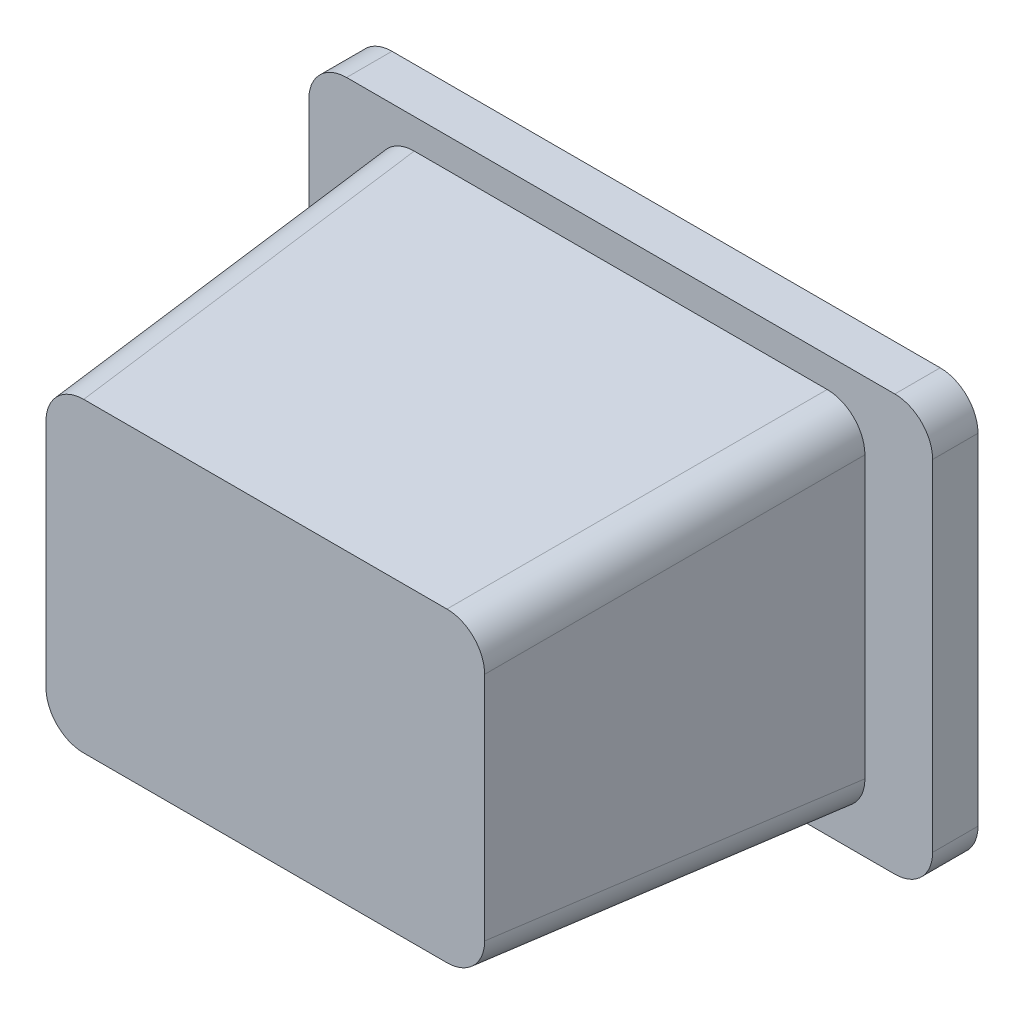
ISO-10303-21;
HEADER;
FILE_DESCRIPTION(('STEP AP214'),'2;1');
FILE_NAME('part.step','',(''),(''),'','','');
FILE_SCHEMA(('AUTOMOTIVE_DESIGN { 1 0 10303 214 1 1 1 1 }'));
ENDSEC;
DATA;
#1=APPLICATION_CONTEXT('core data for automotive mechanical design processes');
#2=APPLICATION_PROTOCOL_DEFINITION('international standard','automotive_design',2000,#1);
#3=PRODUCT_CONTEXT('',#1,'mechanical');
#4=PRODUCT('Part','Part','',(#3));
#5=PRODUCT_RELATED_PRODUCT_CATEGORY('part','',(#4));
#6=PRODUCT_DEFINITION_FORMATION('','',#4);
#7=PRODUCT_DEFINITION_CONTEXT('part definition',#1,'design');
#8=PRODUCT_DEFINITION('design','',#6,#7);
#9=PRODUCT_DEFINITION_SHAPE('','',#8);
#10=(LENGTH_UNIT() NAMED_UNIT(*) SI_UNIT(.MILLI.,.METRE.));
#11=(NAMED_UNIT(*) PLANE_ANGLE_UNIT() SI_UNIT($,.RADIAN.));
#12=(NAMED_UNIT(*) SI_UNIT($,.STERADIAN.) SOLID_ANGLE_UNIT());
#13=UNCERTAINTY_MEASURE_WITH_UNIT(LENGTH_MEASURE(1.E-05),#10,'distance_accuracy_value','');
#14=(GEOMETRIC_REPRESENTATION_CONTEXT(3) GLOBAL_UNCERTAINTY_ASSIGNED_CONTEXT((#13)) GLOBAL_UNIT_ASSIGNED_CONTEXT((#10,
#11,#12)) REPRESENTATION_CONTEXT('',''));
#15=CARTESIAN_POINT('',(0.,0.,0.));
#16=DIRECTION('',(0.,0.,1.));
#17=DIRECTION('',(1.,0.,0.));
#18=AXIS2_PLACEMENT_3D('',#15,#16,#17);
#19=CARTESIAN_POINT('',(-91.2184873949579,67.1428571428571,0.));
#20=DIRECTION('',(-0.997564050259824,0.,0.0697564737441253));
#21=DIRECTION('',(0.0697564737441253,0.,0.997564050259824));
#22=AXIS2_PLACEMENT_3D('',#19,#20,#21);
#23=PLANE('',#22);
#24=DIRECTION('',(0.,-1.,0.));
#25=VECTOR('',#24,1.);
#26=CARTESIAN_POINT('',(-90.7989265232969,67.1428571428571,6.));
#27=LINE('',#26,#25);
#28=CARTESIAN_POINT('',(-90.7989265232969,-17.4619414828836,6.));
#29=VERTEX_POINT('',#28);
#30=CARTESIAN_POINT('',(-90.7989265232969,56.7476557685978,6.));
#31=VERTEX_POINT('',#30);
#32=EDGE_CURVE('E153',#29,#31,#27,.F.);
#33=ORIENTED_EDGE('',*,*,#32,.F.);
#34=DIRECTION('',(0.0695873743166647,0.0695873743166647,0.995145815783509));
#35=VECTOR('',#34,1.);
#36=CARTESIAN_POINT('',(-90.8067652099984,-17.4697801695851,5.88790155759096));
#37=LINE('',#36,#35);
#38=CARTESIAN_POINT('',(-84.2258062006069,-10.8888211601936,100.));
#39=VERTEX_POINT('',#38);
#40=EDGE_CURVE('E197',#29,#39,#37,.T.);
#41=ORIENTED_EDGE('',*,*,#40,.T.);
#42=DIRECTION('',(0.,1.,0.));
#43=VECTOR('',#42,1.);
#44=CARTESIAN_POINT('',(-84.2258062006069,67.1428571428571,100.));
#45=LINE('',#44,#43);
#46=CARTESIAN_POINT('',(-84.2258062006069,50.1745354459078,100.));
#47=VERTEX_POINT('',#46);
#48=EDGE_CURVE('E264',#47,#39,#45,.F.);
#49=ORIENTED_EDGE('',*,*,#48,.F.);
#50=DIRECTION('',(0.0695873743166647,-0.0695873743166647,0.995145815783509));
#51=VECTOR('',#50,1.);
#52=CARTESIAN_POINT('',(-91.2667934631057,57.2155227084066,-0.690808958755056));
#53=LINE('',#52,#51);
#54=EDGE_CURVE('E195',#47,#31,#53,.F.);
#55=ORIENTED_EDGE('',*,*,#54,.T.);
#56=EDGE_LOOP('',(#33,#41,#49,#55));
#57=FACE_BOUND('',#56,.T.);
#58=ADVANCED_FACE('F33',(#57),#23,.T.);
#59=CARTESIAN_POINT('',(-91.218487394958,-27.8571428571429,0.));
#60=DIRECTION('',(0.,-0.997564050259824,0.0697564737441253));
#61=DIRECTION('',(0.,-0.0697564737441253,-0.997564050259824));
#62=AXIS2_PLACEMENT_3D('',#59,#60,#61);
#63=PLANE('',#62);
#64=DIRECTION('',(1.,0.,0.));
#65=VECTOR('',#64,1.);
#66=CARTESIAN_POINT('',(-91.218487394958,-27.4375819854818,6.));
#67=LINE('',#66,#65);
#68=CARTESIAN_POINT('',(28.3863112307827,-27.4375819854818,6.));
#69=VERTEX_POINT('',#68);
#70=CARTESIAN_POINT('',(-80.8232860206986,-27.4375819854818,6.));
#71=VERTEX_POINT('',#70);
#72=EDGE_CURVE('E259',#69,#71,#67,.F.);
#73=ORIENTED_EDGE('',*,*,#72,.F.);
#74=DIRECTION('',(-0.0695873743166647,0.0695873743166647,0.995145815783509));
#75=VECTOR('',#74,1.);
#76=CARTESIAN_POINT('',(28.2246658242342,-27.2759365789332,8.3116370109816));
#77=LINE('',#76,#75);
#78=CARTESIAN_POINT('',(21.8131909080928,-20.8644616627918,100.));
#79=VERTEX_POINT('',#78);
#80=EDGE_CURVE('E193',#69,#79,#77,.T.);
#81=ORIENTED_EDGE('',*,*,#80,.T.);
#82=DIRECTION('',(-1.,0.,0.));
#83=VECTOR('',#82,1.);
#84=CARTESIAN_POINT('',(-91.218487394958,-20.8644616627918,100.));
#85=LINE('',#84,#83);
#86=CARTESIAN_POINT('',(-74.2501656980087,-20.8644616627918,100.));
#87=VERTEX_POINT('',#86);
#88=EDGE_CURVE('E267',#87,#79,#85,.F.);
#89=ORIENTED_EDGE('',*,*,#88,.F.);
#90=DIRECTION('',(0.0695873743166647,0.0695873743166647,0.995145815783509));
#91=VECTOR('',#90,1.);
#92=CARTESIAN_POINT('',(-81.2911529605075,-27.9054489252906,-0.690808958755057));
#93=LINE('',#92,#91);
#94=EDGE_CURVE('E190',#87,#71,#93,.F.);
#95=ORIENTED_EDGE('',*,*,#94,.T.);
#96=EDGE_LOOP('',(#73,#81,#89,#95));
#97=FACE_BOUND('',#96,.T.);
#98=ADVANCED_FACE('F290',(#97),#63,.T.);
#99=CARTESIAN_POINT('',(38.781512605042,67.1428571428571,0.));
#100=DIRECTION('',(0.997564050259824,0.,0.0697564737441253));
#101=DIRECTION('',(0.0697564737441253,0.,-0.997564050259824));
#102=AXIS2_PLACEMENT_3D('',#99,#100,#101);
#103=PLANE('',#102);
#104=DIRECTION('',(0.,1.,0.));
#105=VECTOR('',#104,1.);
#106=CARTESIAN_POINT('',(38.361951733381,67.1428571428571,6.));
#107=LINE('',#106,#105);
#108=CARTESIAN_POINT('',(38.361951733381,56.7476557685978,6.));
#109=VERTEX_POINT('',#108);
#110=CARTESIAN_POINT('',(38.361951733381,-17.4619414828836,6.));
#111=VERTEX_POINT('',#110);
#112=EDGE_CURVE('E257',#109,#111,#107,.F.);
#113=ORIENTED_EDGE('',*,*,#112,.F.);
#114=DIRECTION('',(-0.0695873743166647,-0.0695873743166647,0.995145815783509));
#115=VECTOR('',#114,1.);
#116=CARTESIAN_POINT('',(38.8298186731898,57.2155227084066,-0.690808958755056));
#117=LINE('',#116,#115);
#118=CARTESIAN_POINT('',(31.788831410691,50.1745354459078,100.));
#119=VERTEX_POINT('',#118);
#120=EDGE_CURVE('E181',#109,#119,#117,.T.);
#121=ORIENTED_EDGE('',*,*,#120,.T.);
#122=DIRECTION('',(0.,-1.,0.));
#123=VECTOR('',#122,1.);
#124=CARTESIAN_POINT('',(31.788831410691,67.1428571428571,100.));
#125=LINE('',#124,#123);
#126=CARTESIAN_POINT('',(31.788831410691,-10.8888211601936,100.));
#127=VERTEX_POINT('',#126);
#128=EDGE_CURVE('E270',#127,#119,#125,.F.);
#129=ORIENTED_EDGE('',*,*,#128,.F.);
#130=DIRECTION('',(-0.0695873743166647,0.0695873743166647,0.995145815783509));
#131=VECTOR('',#130,1.);
#132=CARTESIAN_POINT('',(38.3697904200825,-17.4697801695851,5.88790155759096));
#133=LINE('',#132,#131);
#134=EDGE_CURVE('E175',#127,#111,#133,.F.);
#135=ORIENTED_EDGE('',*,*,#134,.T.);
#136=EDGE_LOOP('',(#113,#121,#129,#135));
#137=FACE_BOUND('',#136,.T.);
#138=ADVANCED_FACE('F281',(#137),#103,.T.);
#139=CARTESIAN_POINT('',(-91.2184873949579,67.1428571428571,0.));
#140=DIRECTION('',(0.,0.997564050259824,0.0697564737441253));
#141=DIRECTION('',(0.,-0.0697564737441253,0.997564050259824));
#142=AXIS2_PLACEMENT_3D('',#139,#140,#141);
#143=PLANE('',#142);
#144=DIRECTION('',(1.,0.,0.));
#145=VECTOR('',#144,1.);
#146=CARTESIAN_POINT('',(-91.2184873949579,60.1501759485061,100.));
#147=LINE('',#146,#145);
#148=CARTESIAN_POINT('',(21.8131909080928,60.1501759485061,100.));
#149=VERTEX_POINT('',#148);
#150=CARTESIAN_POINT('',(-74.2501656980087,60.1501759485061,100.));
#151=VERTEX_POINT('',#150);
#152=EDGE_CURVE('E169',#149,#151,#147,.F.);
#153=ORIENTED_EDGE('',*,*,#152,.F.);
#154=DIRECTION('',(-0.0695873743166647,-0.0695873743166647,0.995145815783509));
#155=VECTOR('',#154,1.);
#156=CARTESIAN_POINT('',(28.2246658242342,66.5616508646475,8.3116370109816));
#157=LINE('',#156,#155);
#158=CARTESIAN_POINT('',(28.3863112307828,66.723296271196,6.));
#159=VERTEX_POINT('',#158);
#160=EDGE_CURVE('E168',#149,#159,#157,.F.);
#161=ORIENTED_EDGE('',*,*,#160,.T.);
#162=DIRECTION('',(-1.,0.,0.));
#163=VECTOR('',#162,1.);
#164=CARTESIAN_POINT('',(-91.2184873949579,66.723296271196,6.));
#165=LINE('',#164,#163);
#166=CARTESIAN_POINT('',(-80.8232860206986,66.723296271196,6.));
#167=VERTEX_POINT('',#166);
#168=EDGE_CURVE('E151',#167,#159,#165,.F.);
#169=ORIENTED_EDGE('',*,*,#168,.F.);
#170=DIRECTION('',(0.0695873743166647,-0.0695873743166647,0.995145815783509));
#171=VECTOR('',#170,1.);
#172=CARTESIAN_POINT('',(-81.2911529605075,67.1911632110049,-0.690808958755056));
#173=LINE('',#172,#171);
#174=EDGE_CURVE('E165',#167,#151,#173,.T.);
#175=ORIENTED_EDGE('',*,*,#174,.T.);
#176=EDGE_LOOP('',(#153,#161,#169,#175));
#177=FACE_BOUND('',#176,.T.);
#178=ADVANCED_FACE('F164',(#177),#143,.T.);
#179=CARTESIAN_POINT('',(0.,0.,100.));
#180=DIRECTION('',(0.,0.,1.));
#181=DIRECTION('',(1.,0.,0.));
#182=AXIS2_PLACEMENT_3D('',#179,#180,#181);
#183=PLANE('',#182);
#184=ORIENTED_EDGE('',*,*,#128,.T.);
#185=CARTESIAN_POINT('',(21.7644124298793,50.1257569676944,100.));
#186=DIRECTION('',(0.,0.,1.));
#187=DIRECTION('',(0.707106781186548,0.707106781186548,0.));
#188=AXIS2_PLACEMENT_3D('',#185,#186,#187);
#189=ELLIPSE('',#188,10.0487786225848,10.);
#190=EDGE_CURVE('E188',#119,#149,#189,.T.);
#191=ORIENTED_EDGE('',*,*,#190,.T.);
#192=ORIENTED_EDGE('',*,*,#152,.T.);
#193=CARTESIAN_POINT('',(-74.2013872197952,50.1257569676944,100.));
#194=DIRECTION('',(0.,0.,1.));
#195=DIRECTION('',(-0.707106781186547,0.707106781186548,0.));
#196=AXIS2_PLACEMENT_3D('',#193,#194,#195);
#197=ELLIPSE('',#196,10.0487786225848,10.);
#198=EDGE_CURVE('E173',#151,#47,#197,.T.);
#199=ORIENTED_EDGE('',*,*,#198,.T.);
#200=ORIENTED_EDGE('',*,*,#48,.T.);
#201=CARTESIAN_POINT('',(-74.2013872197952,-10.8400426819801,100.));
#202=DIRECTION('',(0.,0.,1.));
#203=DIRECTION('',(-0.707106781186548,-0.707106781186547,0.));
#204=AXIS2_PLACEMENT_3D('',#201,#202,#203);
#205=ELLIPSE('',#204,10.0487786225848,10.);
#206=EDGE_CURVE('E184',#39,#87,#205,.T.);
#207=ORIENTED_EDGE('',*,*,#206,.T.);
#208=ORIENTED_EDGE('',*,*,#88,.T.);
#209=CARTESIAN_POINT('',(21.7644124298793,-10.8400426819801,100.));
#210=DIRECTION('',(0.,0.,1.));
#211=DIRECTION('',(0.707106781186548,-0.707106781186548,0.));
#212=AXIS2_PLACEMENT_3D('',#209,#210,#211);
#213=ELLIPSE('',#212,10.0487786225848,10.);
#214=EDGE_CURVE('E186',#79,#127,#213,.T.);
#215=ORIENTED_EDGE('',*,*,#214,.T.);
#216=EDGE_LOOP('',(#184,#191,#192,#199,#200,#207,#208,#215));
#217=FACE_BOUND('',#216,.T.);
#218=ADVANCED_FACE('F273',(#217),#183,.T.);
#219=CARTESIAN_POINT('',(0.,0.,6.));
#220=DIRECTION('',(0.,0.,-1.));
#221=DIRECTION('',(-1.,0.,0.));
#222=AXIS2_PLACEMENT_3D('',#219,#220,#221);
#223=PLANE('',#222);
#224=DIRECTION('',(0.,1.,0.));
#225=VECTOR('',#224,1.);
#226=CARTESIAN_POINT('',(56.281512605042,74.6428571428571,6.));
#227=LINE('',#226,#225);
#228=CARTESIAN_POINT('',(56.2815126050421,-25.3571428571429,6.));
#229=VERTEX_POINT('',#228);
#230=CARTESIAN_POINT('',(56.281512605042,64.6428571428571,6.));
#231=VERTEX_POINT('',#230);
#232=EDGE_CURVE('E251',#229,#231,#227,.T.);
#233=ORIENTED_EDGE('',*,*,#232,.T.);
#234=CARTESIAN_POINT('',(46.281512605042,64.6428571428571,6.));
#235=DIRECTION('',(0.,0.,-1.));
#236=DIRECTION('',(-1.,0.,0.));
#237=AXIS2_PLACEMENT_3D('',#234,#235,#236);
#238=CIRCLE('',#237,10.);
#239=CARTESIAN_POINT('',(46.281512605042,74.6428571428571,6.));
#240=VERTEX_POINT('',#239);
#241=EDGE_CURVE('E226',#231,#240,#238,.F.);
#242=ORIENTED_EDGE('',*,*,#241,.T.);
#243=DIRECTION('',(-1.,0.,0.));
#244=VECTOR('',#243,1.);
#245=CARTESIAN_POINT('',(56.281512605042,74.6428571428571,6.));
#246=LINE('',#245,#244);
#247=CARTESIAN_POINT('',(-98.718487394958,74.642857142857,6.));
#248=VERTEX_POINT('',#247);
#249=EDGE_CURVE('E344',#240,#248,#246,.T.);
#250=ORIENTED_EDGE('',*,*,#249,.T.);
#251=CARTESIAN_POINT('',(-98.718487394958,64.642857142857,6.));
#252=DIRECTION('',(0.,0.,-1.));
#253=DIRECTION('',(-1.,0.,0.));
#254=AXIS2_PLACEMENT_3D('',#251,#252,#253);
#255=CIRCLE('',#254,10.);
#256=CARTESIAN_POINT('',(-108.718487394958,64.642857142857,6.));
#257=VERTEX_POINT('',#256);
#258=EDGE_CURVE('E221',#248,#257,#255,.F.);
#259=ORIENTED_EDGE('',*,*,#258,.T.);
#260=DIRECTION('',(0.,-1.,0.));
#261=VECTOR('',#260,1.);
#262=CARTESIAN_POINT('',(-108.718487394958,74.642857142857,6.));
#263=LINE('',#262,#261);
#264=CARTESIAN_POINT('',(-108.718487394958,-25.3571428571429,6.));
#265=VERTEX_POINT('',#264);
#266=EDGE_CURVE('E240',#257,#265,#263,.T.);
#267=ORIENTED_EDGE('',*,*,#266,.T.);
#268=CARTESIAN_POINT('',(-98.7184873949579,-25.3571428571429,6.));
#269=DIRECTION('',(0.,0.,-1.));
#270=DIRECTION('',(-1.,0.,0.));
#271=AXIS2_PLACEMENT_3D('',#268,#269,#270);
#272=CIRCLE('',#271,10.);
#273=CARTESIAN_POINT('',(-98.7184873949579,-35.3571428571429,6.));
#274=VERTEX_POINT('',#273);
#275=EDGE_CURVE('E55',#265,#274,#272,.F.);
#276=ORIENTED_EDGE('',*,*,#275,.T.);
#277=DIRECTION('',(1.,0.,0.));
#278=VECTOR('',#277,1.);
#279=CARTESIAN_POINT('',(56.2815126050421,-35.3571428571429,6.));
#280=LINE('',#279,#278);
#281=CARTESIAN_POINT('',(46.2815126050421,-35.3571428571429,6.));
#282=VERTEX_POINT('',#281);
#283=EDGE_CURVE('E260',#274,#282,#280,.T.);
#284=ORIENTED_EDGE('',*,*,#283,.T.);
#285=CARTESIAN_POINT('',(46.2815126050421,-25.3571428571429,6.));
#286=DIRECTION('',(0.,0.,-1.));
#287=DIRECTION('',(-1.,0.,0.));
#288=AXIS2_PLACEMENT_3D('',#285,#286,#287);
#289=CIRCLE('',#288,10.);
#290=EDGE_CURVE('E224',#282,#229,#289,.F.);
#291=ORIENTED_EDGE('',*,*,#290,.T.);
#292=EDGE_LOOP('',(#233,#242,#250,#259,#267,#276,#284,#291));
#293=FACE_BOUND('',#292,.T.);
#294=ORIENTED_EDGE('',*,*,#112,.T.);
#295=CARTESIAN_POINT('',(28.3375327525693,-17.4131630046701,6.));
#296=DIRECTION('',(0.,0.,-1.));
#297=DIRECTION('',(0.707106781186548,-0.707106781186548,0.));
#298=AXIS2_PLACEMENT_3D('',#295,#296,#297);
#299=ELLIPSE('',#298,10.0487786225848,10.);
#300=EDGE_CURVE('E201',#111,#69,#299,.T.);
#301=ORIENTED_EDGE('',*,*,#300,.T.);
#302=ORIENTED_EDGE('',*,*,#72,.T.);
#303=CARTESIAN_POINT('',(-80.7745075424852,-17.4131630046701,6.));
#304=DIRECTION('',(0.,0.,-1.));
#305=DIRECTION('',(-0.707106781186548,-0.707106781186547,0.));
#306=AXIS2_PLACEMENT_3D('',#303,#304,#305);
#307=ELLIPSE('',#306,10.0487786225848,10.);
#308=EDGE_CURVE('E159',#71,#29,#307,.T.);
#309=ORIENTED_EDGE('',*,*,#308,.T.);
#310=ORIENTED_EDGE('',*,*,#32,.T.);
#311=CARTESIAN_POINT('',(-80.7745075424852,56.6988772903843,6.));
#312=DIRECTION('',(0.,0.,-1.));
#313=DIRECTION('',(-0.707106781186547,0.707106781186548,0.));
#314=AXIS2_PLACEMENT_3D('',#311,#312,#313);
#315=ELLIPSE('',#314,10.0487786225848,10.);
#316=EDGE_CURVE('E147',#31,#167,#315,.T.);
#317=ORIENTED_EDGE('',*,*,#316,.T.);
#318=ORIENTED_EDGE('',*,*,#168,.T.);
#319=CARTESIAN_POINT('',(28.3375327525693,56.6988772903843,6.));
#320=DIRECTION('',(0.,0.,-1.));
#321=DIRECTION('',(0.707106781186548,0.707106781186548,0.));
#322=AXIS2_PLACEMENT_3D('',#319,#320,#321);
#323=ELLIPSE('',#322,10.0487786225848,10.);
#324=EDGE_CURVE('E199',#159,#109,#323,.T.);
#325=ORIENTED_EDGE('',*,*,#324,.T.);
#326=EDGE_LOOP('',(#294,#301,#302,#309,#310,#317,#318,#325));
#327=FACE_BOUND('',#326,.T.);
#328=ADVANCED_FACE('F150',(#293,#327),#223,.F.);
#329=CARTESIAN_POINT('',(56.281512605042,74.6428571428571,6.));
#330=DIRECTION('',(-1.,0.,0.));
#331=DIRECTION('',(0.,-1.,0.));
#332=AXIS2_PLACEMENT_3D('',#329,#330,#331);
#333=PLANE('',#332);
#334=DIRECTION('',(0.,1.,0.));
#335=VECTOR('',#334,1.);
#336=CARTESIAN_POINT('',(56.281512605042,74.6428571428571,-6.));
#337=LINE('',#336,#335);
#338=CARTESIAN_POINT('',(56.2815126050421,-25.3571428571429,-6.));
#339=VERTEX_POINT('',#338);
#340=CARTESIAN_POINT('',(56.281512605042,64.6428571428571,-6.));
#341=VERTEX_POINT('',#340);
#342=EDGE_CURVE('E253',#339,#341,#337,.T.);
#343=ORIENTED_EDGE('',*,*,#342,.T.);
#344=DIRECTION('',(0.,0.,-1.));
#345=VECTOR('',#344,1.);
#346=CARTESIAN_POINT('',(56.281512605042,64.6428571428571,6.));
#347=LINE('',#346,#345);
#348=EDGE_CURVE('E219',#341,#231,#347,.F.);
#349=ORIENTED_EDGE('',*,*,#348,.T.);
#350=ORIENTED_EDGE('',*,*,#232,.F.);
#351=DIRECTION('',(0.,0.,-1.));
#352=VECTOR('',#351,1.);
#353=CARTESIAN_POINT('',(56.2815126050421,-25.3571428571429,6.));
#354=LINE('',#353,#352);
#355=EDGE_CURVE('E216',#229,#339,#354,.T.);
#356=ORIENTED_EDGE('',*,*,#355,.T.);
#357=EDGE_LOOP('',(#343,#349,#350,#356));
#358=FACE_BOUND('',#357,.T.);
#359=ADVANCED_FACE('F340',(#358),#333,.F.);
#360=CARTESIAN_POINT('',(56.281512605042,74.6428571428571,6.));
#361=DIRECTION('',(0.,-1.,0.));
#362=DIRECTION('',(1.,0.,0.));
#363=AXIS2_PLACEMENT_3D('',#360,#361,#362);
#364=PLANE('',#363);
#365=ORIENTED_EDGE('',*,*,#249,.F.);
#366=DIRECTION('',(0.,0.,-1.));
#367=VECTOR('',#366,1.);
#368=CARTESIAN_POINT('',(46.281512605042,74.6428571428571,6.));
#369=LINE('',#368,#367);
#370=CARTESIAN_POINT('',(46.281512605042,74.6428571428571,-6.));
#371=VERTEX_POINT('',#370);
#372=EDGE_CURVE('E205',#240,#371,#369,.T.);
#373=ORIENTED_EDGE('',*,*,#372,.T.);
#374=DIRECTION('',(-1.,0.,0.));
#375=VECTOR('',#374,1.);
#376=CARTESIAN_POINT('',(56.281512605042,74.6428571428571,-6.));
#377=LINE('',#376,#375);
#378=CARTESIAN_POINT('',(-98.718487394958,74.642857142857,-6.));
#379=VERTEX_POINT('',#378);
#380=EDGE_CURVE('E249',#371,#379,#377,.T.);
#381=ORIENTED_EDGE('',*,*,#380,.T.);
#382=DIRECTION('',(0.,0.,-1.));
#383=VECTOR('',#382,1.);
#384=CARTESIAN_POINT('',(-98.718487394958,74.642857142857,6.));
#385=LINE('',#384,#383);
#386=EDGE_CURVE('E158',#379,#248,#385,.F.);
#387=ORIENTED_EDGE('',*,*,#386,.T.);
#388=EDGE_LOOP('',(#365,#373,#381,#387));
#389=FACE_BOUND('',#388,.T.);
#390=ADVANCED_FACE('F356',(#389),#364,.F.);
#391=CARTESIAN_POINT('',(-108.718487394958,74.642857142857,6.));
#392=DIRECTION('',(1.,0.,0.));
#393=DIRECTION('',(0.,1.,0.));
#394=AXIS2_PLACEMENT_3D('',#391,#392,#393);
#395=PLANE('',#394);
#396=DIRECTION('',(0.,-1.,0.));
#397=VECTOR('',#396,1.);
#398=CARTESIAN_POINT('',(-108.718487394958,74.642857142857,-6.));
#399=LINE('',#398,#397);
#400=CARTESIAN_POINT('',(-108.718487394958,64.642857142857,-6.));
#401=VERTEX_POINT('',#400);
#402=CARTESIAN_POINT('',(-108.718487394958,-25.3571428571429,-6.));
#403=VERTEX_POINT('',#402);
#404=EDGE_CURVE('E238',#401,#403,#399,.T.);
#405=ORIENTED_EDGE('',*,*,#404,.T.);
#406=DIRECTION('',(0.,0.,-1.));
#407=VECTOR('',#406,1.);
#408=CARTESIAN_POINT('',(-108.718487394958,-25.3571428571429,6.));
#409=LINE('',#408,#407);
#410=EDGE_CURVE('E11',#403,#265,#409,.F.);
#411=ORIENTED_EDGE('',*,*,#410,.T.);
#412=ORIENTED_EDGE('',*,*,#266,.F.);
#413=DIRECTION('',(0.,0.,-1.));
#414=VECTOR('',#413,1.);
#415=CARTESIAN_POINT('',(-108.718487394958,64.642857142857,6.));
#416=LINE('',#415,#414);
#417=EDGE_CURVE('E41',#257,#401,#416,.T.);
#418=ORIENTED_EDGE('',*,*,#417,.T.);
#419=EDGE_LOOP('',(#405,#411,#412,#418));
#420=FACE_BOUND('',#419,.T.);
#421=ADVANCED_FACE('F237',(#420),#395,.F.);
#422=CARTESIAN_POINT('',(56.2815126050421,-35.3571428571429,6.));
#423=DIRECTION('',(0.,1.,0.));
#424=DIRECTION('',(-1.,0.,0.));
#425=AXIS2_PLACEMENT_3D('',#422,#423,#424);
#426=PLANE('',#425);
#427=DIRECTION('',(1.,0.,0.));
#428=VECTOR('',#427,1.);
#429=CARTESIAN_POINT('',(56.2815126050421,-35.3571428571429,-6.));
#430=LINE('',#429,#428);
#431=CARTESIAN_POINT('',(-98.7184873949579,-35.3571428571429,-6.));
#432=VERTEX_POINT('',#431);
#433=CARTESIAN_POINT('',(46.2815126050421,-35.3571428571429,-6.));
#434=VERTEX_POINT('',#433);
#435=EDGE_CURVE('E248',#432,#434,#430,.T.);
#436=ORIENTED_EDGE('',*,*,#435,.T.);
#437=DIRECTION('',(0.,0.,-1.));
#438=VECTOR('',#437,1.);
#439=CARTESIAN_POINT('',(46.2815126050421,-35.3571428571429,6.));
#440=LINE('',#439,#438);
#441=EDGE_CURVE('E48',#434,#282,#440,.F.);
#442=ORIENTED_EDGE('',*,*,#441,.T.);
#443=ORIENTED_EDGE('',*,*,#283,.F.);
#444=DIRECTION('',(0.,0.,-1.));
#445=VECTOR('',#444,1.);
#446=CARTESIAN_POINT('',(-98.7184873949579,-35.3571428571429,6.));
#447=LINE('',#446,#445);
#448=EDGE_CURVE('E228',#274,#432,#447,.T.);
#449=ORIENTED_EDGE('',*,*,#448,.T.);
#450=EDGE_LOOP('',(#436,#442,#443,#449));
#451=FACE_BOUND('',#450,.T.);
#452=ADVANCED_FACE('F333',(#451),#426,.F.);
#453=CARTESIAN_POINT('',(0.,0.,-6.));
#454=DIRECTION('',(0.,0.,-1.));
#455=DIRECTION('',(-1.,0.,0.));
#456=AXIS2_PLACEMENT_3D('',#453,#454,#455);
#457=PLANE('',#456);
#458=ORIENTED_EDGE('',*,*,#380,.F.);
#459=CARTESIAN_POINT('',(46.281512605042,64.6428571428571,-6.));
#460=DIRECTION('',(0.,0.,-1.));
#461=DIRECTION('',(-1.,0.,0.));
#462=AXIS2_PLACEMENT_3D('',#459,#460,#461);
#463=CIRCLE('',#462,10.);
#464=EDGE_CURVE('E214',#371,#341,#463,.T.);
#465=ORIENTED_EDGE('',*,*,#464,.T.);
#466=ORIENTED_EDGE('',*,*,#342,.F.);
#467=CARTESIAN_POINT('',(46.2815126050421,-25.3571428571429,-6.));
#468=DIRECTION('',(0.,0.,-1.));
#469=DIRECTION('',(-1.,0.,0.));
#470=AXIS2_PLACEMENT_3D('',#467,#468,#469);
#471=CIRCLE('',#470,10.);
#472=EDGE_CURVE('E212',#339,#434,#471,.T.);
#473=ORIENTED_EDGE('',*,*,#472,.T.);
#474=ORIENTED_EDGE('',*,*,#435,.F.);
#475=CARTESIAN_POINT('',(-98.7184873949579,-25.3571428571429,-6.));
#476=DIRECTION('',(0.,0.,-1.));
#477=DIRECTION('',(-1.,0.,0.));
#478=AXIS2_PLACEMENT_3D('',#475,#476,#477);
#479=CIRCLE('',#478,10.);
#480=EDGE_CURVE('E210',#432,#403,#479,.T.);
#481=ORIENTED_EDGE('',*,*,#480,.T.);
#482=ORIENTED_EDGE('',*,*,#404,.F.);
#483=CARTESIAN_POINT('',(-98.718487394958,64.642857142857,-6.));
#484=DIRECTION('',(0.,0.,-1.));
#485=DIRECTION('',(-1.,0.,0.));
#486=AXIS2_PLACEMENT_3D('',#483,#484,#485);
#487=CIRCLE('',#486,10.);
#488=EDGE_CURVE('E208',#401,#379,#487,.T.);
#489=ORIENTED_EDGE('',*,*,#488,.T.);
#490=EDGE_LOOP('',(#458,#465,#466,#473,#474,#481,#482,#489));
#491=FACE_BOUND('',#490,.T.);
#492=ADVANCED_FACE('F245',(#491),#457,.T.);
#493=CARTESIAN_POINT('',(28.2246658242342,56.5860103620492,7.61407227354035));
#494=DIRECTION('',(0.0695873743166647,0.0695873743166647,-0.995145815783508));
#495=DIRECTION('',(-0.997564050259824,0.,-0.0697564737441253));
#496=AXIS2_PLACEMENT_3D('',#493,#494,#495);
#497=CYLINDRICAL_SURFACE('',#496,10.);
#498=ORIENTED_EDGE('',*,*,#190,.F.);
#499=ORIENTED_EDGE('',*,*,#120,.F.);
#500=ORIENTED_EDGE('',*,*,#324,.F.);
#501=ORIENTED_EDGE('',*,*,#160,.F.);
#502=EDGE_LOOP('',(#498,#499,#500,#501));
#503=FACE_BOUND('',#502,.T.);
#504=ADVANCED_FACE('F277',(#503),#497,.T.);
#505=CARTESIAN_POINT('',(28.3941499174842,-17.4697801695851,5.19033682014971));
#506=DIRECTION('',(0.0695873743166647,-0.0695873743166647,-0.995145815783508));
#507=DIRECTION('',(-0.997564050259824,0.,-0.0697564737441253));
#508=AXIS2_PLACEMENT_3D('',#505,#506,#507);
#509=CYLINDRICAL_SURFACE('',#508,10.);
#510=ORIENTED_EDGE('',*,*,#214,.F.);
#511=ORIENTED_EDGE('',*,*,#80,.F.);
#512=ORIENTED_EDGE('',*,*,#300,.F.);
#513=ORIENTED_EDGE('',*,*,#134,.F.);
#514=EDGE_LOOP('',(#510,#511,#512,#513));
#515=FACE_BOUND('',#514,.T.);
#516=ADVANCED_FACE('F286',(#515),#509,.T.);
#517=CARTESIAN_POINT('',(-81.2911529605075,-17.9298084226924,-1.38837369619631));
#518=DIRECTION('',(-0.0695873743166647,-0.0695873743166647,-0.995145815783508));
#519=DIRECTION('',(-0.997564050259824,0.,0.0697564737441254));
#520=AXIS2_PLACEMENT_3D('',#517,#518,#519);
#521=CYLINDRICAL_SURFACE('',#520,10.);
#522=ORIENTED_EDGE('',*,*,#206,.F.);
#523=ORIENTED_EDGE('',*,*,#40,.F.);
#524=ORIENTED_EDGE('',*,*,#308,.F.);
#525=ORIENTED_EDGE('',*,*,#94,.F.);
#526=EDGE_LOOP('',(#522,#523,#524,#525));
#527=FACE_BOUND('',#526,.T.);
#528=ADVANCED_FACE('F295',(#527),#521,.T.);
#529=CARTESIAN_POINT('',(-81.2911529605075,57.2155227084066,-1.38837369619631));
#530=DIRECTION('',(-0.0695873743166647,0.0695873743166647,-0.995145815783508));
#531=DIRECTION('',(0.,0.997564050259824,0.0697564737441253));
#532=AXIS2_PLACEMENT_3D('',#529,#530,#531);
#533=CYLINDRICAL_SURFACE('',#532,10.);
#534=ORIENTED_EDGE('',*,*,#198,.F.);
#535=ORIENTED_EDGE('',*,*,#174,.F.);
#536=ORIENTED_EDGE('',*,*,#316,.F.);
#537=ORIENTED_EDGE('',*,*,#54,.F.);
#538=EDGE_LOOP('',(#534,#535,#536,#537));
#539=FACE_BOUND('',#538,.T.);
#540=ADVANCED_FACE('F172',(#539),#533,.T.);
#541=CARTESIAN_POINT('',(46.281512605042,64.6428571428571,6.));
#542=DIRECTION('',(0.,0.,-1.));
#543=DIRECTION('',(-1.,0.,0.));
#544=AXIS2_PLACEMENT_3D('',#541,#542,#543);
#545=CYLINDRICAL_SURFACE('',#544,10.);
#546=ORIENTED_EDGE('',*,*,#241,.F.);
#547=ORIENTED_EDGE('',*,*,#348,.F.);
#548=ORIENTED_EDGE('',*,*,#464,.F.);
#549=ORIENTED_EDGE('',*,*,#372,.F.);
#550=EDGE_LOOP('',(#546,#547,#548,#549));
#551=FACE_BOUND('',#550,.T.);
#552=ADVANCED_FACE('F319',(#551),#545,.T.);
#553=CARTESIAN_POINT('',(46.2815126050421,-25.3571428571429,6.));
#554=DIRECTION('',(0.,0.,-1.));
#555=DIRECTION('',(-1.,0.,0.));
#556=AXIS2_PLACEMENT_3D('',#553,#554,#555);
#557=CYLINDRICAL_SURFACE('',#556,10.);
#558=ORIENTED_EDGE('',*,*,#290,.F.);
#559=ORIENTED_EDGE('',*,*,#441,.F.);
#560=ORIENTED_EDGE('',*,*,#472,.F.);
#561=ORIENTED_EDGE('',*,*,#355,.F.);
#562=EDGE_LOOP('',(#558,#559,#560,#561));
#563=FACE_BOUND('',#562,.T.);
#564=ADVANCED_FACE('F322',(#563),#557,.T.);
#565=CARTESIAN_POINT('',(-98.7184873949579,-25.3571428571429,6.));
#566=DIRECTION('',(0.,0.,-1.));
#567=DIRECTION('',(-1.,0.,0.));
#568=AXIS2_PLACEMENT_3D('',#565,#566,#567);
#569=CYLINDRICAL_SURFACE('',#568,10.);
#570=ORIENTED_EDGE('',*,*,#275,.F.);
#571=ORIENTED_EDGE('',*,*,#410,.F.);
#572=ORIENTED_EDGE('',*,*,#480,.F.);
#573=ORIENTED_EDGE('',*,*,#448,.F.);
#574=EDGE_LOOP('',(#570,#571,#572,#573));
#575=FACE_BOUND('',#574,.T.);
#576=ADVANCED_FACE('F325',(#575),#569,.T.);
#577=CARTESIAN_POINT('',(-98.718487394958,64.642857142857,6.));
#578=DIRECTION('',(0.,0.,-1.));
#579=DIRECTION('',(-1.,0.,0.));
#580=AXIS2_PLACEMENT_3D('',#577,#578,#579);
#581=CYLINDRICAL_SURFACE('',#580,10.);
#582=ORIENTED_EDGE('',*,*,#258,.F.);
#583=ORIENTED_EDGE('',*,*,#386,.F.);
#584=ORIENTED_EDGE('',*,*,#488,.F.);
#585=ORIENTED_EDGE('',*,*,#417,.F.);
#586=EDGE_LOOP('',(#582,#583,#584,#585));
#587=FACE_BOUND('',#586,.T.);
#588=ADVANCED_FACE('F35',(#587),#581,.T.);
#589=CLOSED_SHELL('',(#58,#98,#138,#178,#218,#328,#359,#390,#421,#452,#492,#504,#516,#528,#540,
#552,#564,#576,#588));
#590=MANIFOLD_SOLID_BREP('B2',#589);
#591=ADVANCED_BREP_SHAPE_REPRESENTATION('',(#18,#590),#14);
#592=SHAPE_DEFINITION_REPRESENTATION(#9,#591);
ENDSEC;
END-ISO-10303-21;
